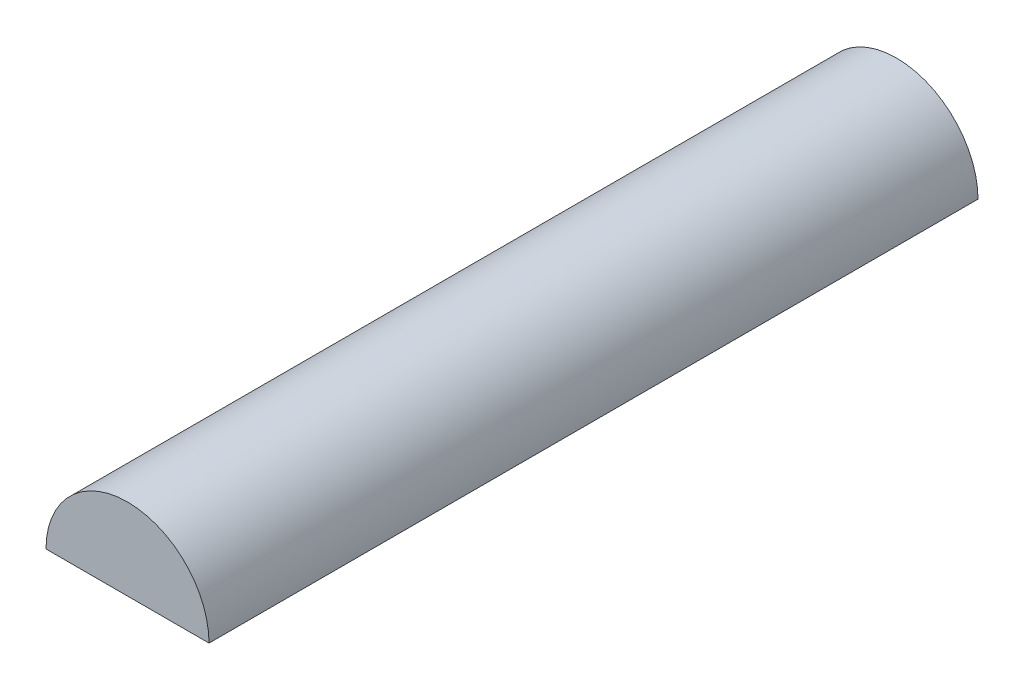
ISO-10303-21;
HEADER;
FILE_DESCRIPTION(('STEP AP214'),'2;1');
FILE_NAME('part.step','',(''),(''),'','','');
FILE_SCHEMA(('AUTOMOTIVE_DESIGN { 1 0 10303 214 1 1 1 1 }'));
ENDSEC;
DATA;
#1=APPLICATION_CONTEXT('core data for automotive mechanical design processes');
#2=APPLICATION_PROTOCOL_DEFINITION('international standard','automotive_design',2000,#1);
#3=PRODUCT_CONTEXT('',#1,'mechanical');
#4=PRODUCT('Part','Part','',(#3));
#5=PRODUCT_RELATED_PRODUCT_CATEGORY('part','',(#4));
#6=PRODUCT_DEFINITION_FORMATION('','',#4);
#7=PRODUCT_DEFINITION_CONTEXT('part definition',#1,'design');
#8=PRODUCT_DEFINITION('design','',#6,#7);
#9=PRODUCT_DEFINITION_SHAPE('','',#8);
#10=(LENGTH_UNIT() NAMED_UNIT(*) SI_UNIT(.MILLI.,.METRE.));
#11=(NAMED_UNIT(*) PLANE_ANGLE_UNIT() SI_UNIT($,.RADIAN.));
#12=(NAMED_UNIT(*) SI_UNIT($,.STERADIAN.) SOLID_ANGLE_UNIT());
#13=UNCERTAINTY_MEASURE_WITH_UNIT(LENGTH_MEASURE(1.E-05),#10,'distance_accuracy_value','');
#14=(GEOMETRIC_REPRESENTATION_CONTEXT(3) GLOBAL_UNCERTAINTY_ASSIGNED_CONTEXT((#13)) GLOBAL_UNIT_ASSIGNED_CONTEXT((#10,
#11,#12)) REPRESENTATION_CONTEXT('',''));
#15=CARTESIAN_POINT('',(0.,0.,0.));
#16=DIRECTION('',(0.,0.,1.));
#17=DIRECTION('',(1.,0.,0.));
#18=AXIS2_PLACEMENT_3D('',#15,#16,#17);
#19=CARTESIAN_POINT('',(0.,0.,25.));
#20=DIRECTION('',(0.,0.,-1.));
#21=DIRECTION('',(-1.,0.,0.));
#22=AXIS2_PLACEMENT_3D('',#19,#20,#21);
#23=CYLINDRICAL_SURFACE('',#22,2.65);
#24=CARTESIAN_POINT('',(0.,0.,0.));
#25=DIRECTION('',(0.,0.,1.));
#26=DIRECTION('',(1.,0.,0.));
#27=AXIS2_PLACEMENT_3D('',#24,#25,#26);
#28=CIRCLE('',#27,2.65);
#29=CARTESIAN_POINT('',(2.65,0.,0.));
#30=VERTEX_POINT('',#29);
#31=CARTESIAN_POINT('',(-2.65,0.,0.));
#32=VERTEX_POINT('',#31);
#33=EDGE_CURVE('E72',#30,#32,#28,.T.);
#34=ORIENTED_EDGE('',*,*,#33,.T.);
#35=DIRECTION('',(0.,0.,-1.));
#36=VECTOR('',#35,1.);
#37=CARTESIAN_POINT('',(-2.65,0.,25.));
#38=LINE('',#37,#36);
#39=CARTESIAN_POINT('',(-2.65,0.,25.));
#40=VERTEX_POINT('',#39);
#41=EDGE_CURVE('E11',#40,#32,#38,.T.);
#42=ORIENTED_EDGE('',*,*,#41,.F.);
#43=CARTESIAN_POINT('',(0.,0.,25.));
#44=DIRECTION('',(0.,0.,1.));
#45=DIRECTION('',(1.,0.,0.));
#46=AXIS2_PLACEMENT_3D('',#43,#44,#45);
#47=CIRCLE('',#46,2.65);
#48=CARTESIAN_POINT('',(2.65,0.,25.));
#49=VERTEX_POINT('',#48);
#50=EDGE_CURVE('E71',#49,#40,#47,.T.);
#51=ORIENTED_EDGE('',*,*,#50,.F.);
#52=DIRECTION('',(0.,0.,-1.));
#53=VECTOR('',#52,1.);
#54=CARTESIAN_POINT('',(2.65,0.,25.));
#55=LINE('',#54,#53);
#56=EDGE_CURVE('E48',#49,#30,#55,.T.);
#57=ORIENTED_EDGE('',*,*,#56,.T.);
#58=EDGE_LOOP('',(#34,#42,#51,#57));
#59=FACE_BOUND('',#58,.T.);
#60=ADVANCED_FACE('F39',(#59),#23,.T.);
#61=CARTESIAN_POINT('',(-2.65,0.,25.));
#62=DIRECTION('',(0.,1.,0.));
#63=DIRECTION('',(0.,0.,1.));
#64=AXIS2_PLACEMENT_3D('',#61,#62,#63);
#65=PLANE('',#64);
#66=DIRECTION('',(1.,0.,0.));
#67=VECTOR('',#66,1.);
#68=CARTESIAN_POINT('',(-2.65,0.,0.));
#69=LINE('',#68,#67);
#70=EDGE_CURVE('E63',#32,#30,#69,.T.);
#71=ORIENTED_EDGE('',*,*,#70,.T.);
#72=ORIENTED_EDGE('',*,*,#56,.F.);
#73=DIRECTION('',(1.,0.,0.));
#74=VECTOR('',#73,1.);
#75=CARTESIAN_POINT('',(-2.65,0.,25.));
#76=LINE('',#75,#74);
#77=EDGE_CURVE('E55',#40,#49,#76,.T.);
#78=ORIENTED_EDGE('',*,*,#77,.F.);
#79=ORIENTED_EDGE('',*,*,#41,.T.);
#80=EDGE_LOOP('',(#71,#72,#78,#79));
#81=FACE_BOUND('',#80,.T.);
#82=ADVANCED_FACE('F66',(#81),#65,.F.);
#83=CARTESIAN_POINT('',(0.,0.,25.));
#84=DIRECTION('',(0.,0.,1.));
#85=DIRECTION('',(1.,0.,0.));
#86=AXIS2_PLACEMENT_3D('',#83,#84,#85);
#87=PLANE('',#86);
#88=ORIENTED_EDGE('',*,*,#50,.T.);
#89=ORIENTED_EDGE('',*,*,#77,.T.);
#90=EDGE_LOOP('',(#88,#89));
#91=FACE_BOUND('',#90,.T.);
#92=ADVANCED_FACE('F83',(#91),#87,.T.);
#93=CARTESIAN_POINT('',(0.,0.,0.));
#94=DIRECTION('',(0.,0.,1.));
#95=DIRECTION('',(1.,0.,0.));
#96=AXIS2_PLACEMENT_3D('',#93,#94,#95);
#97=PLANE('',#96);
#98=ORIENTED_EDGE('',*,*,#33,.F.);
#99=ORIENTED_EDGE('',*,*,#70,.F.);
#100=EDGE_LOOP('',(#98,#99));
#101=FACE_BOUND('',#100,.T.);
#102=ADVANCED_FACE('F76',(#101),#97,.F.);
#103=CLOSED_SHELL('',(#60,#82,#92,#102));
#104=MANIFOLD_SOLID_BREP('B2',#103);
#105=ADVANCED_BREP_SHAPE_REPRESENTATION('',(#18,#104),#14);
#106=SHAPE_DEFINITION_REPRESENTATION(#9,#105);
ENDSEC;
END-ISO-10303-21;
